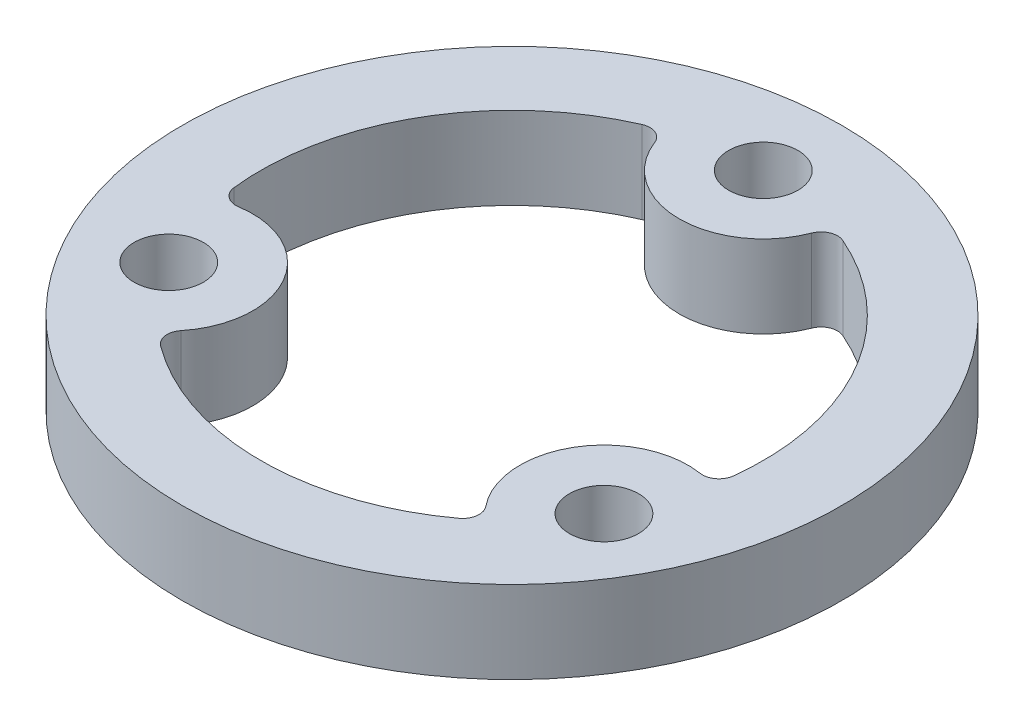
ISO-10303-21;
HEADER;
FILE_DESCRIPTION(('STEP AP214'),'2;1');
FILE_NAME('part.step','',(''),(''),'','','');
FILE_SCHEMA(('AUTOMOTIVE_DESIGN { 1 0 10303 214 1 1 1 1 }'));
ENDSEC;
DATA;
#1=APPLICATION_CONTEXT('core data for automotive mechanical design processes');
#2=APPLICATION_PROTOCOL_DEFINITION('international standard','automotive_design',2000,#1);
#3=PRODUCT_CONTEXT('',#1,'mechanical');
#4=PRODUCT('Part','Part','',(#3));
#5=PRODUCT_RELATED_PRODUCT_CATEGORY('part','',(#4));
#6=PRODUCT_DEFINITION_FORMATION('','',#4);
#7=PRODUCT_DEFINITION_CONTEXT('part definition',#1,'design');
#8=PRODUCT_DEFINITION('design','',#6,#7);
#9=PRODUCT_DEFINITION_SHAPE('','',#8);
#10=(LENGTH_UNIT() NAMED_UNIT(*) SI_UNIT(.MILLI.,.METRE.));
#11=(NAMED_UNIT(*) PLANE_ANGLE_UNIT() SI_UNIT($,.RADIAN.));
#12=(NAMED_UNIT(*) SI_UNIT($,.STERADIAN.) SOLID_ANGLE_UNIT());
#13=UNCERTAINTY_MEASURE_WITH_UNIT(LENGTH_MEASURE(1.E-05),#10,'distance_accuracy_value','');
#14=(GEOMETRIC_REPRESENTATION_CONTEXT(3) GLOBAL_UNCERTAINTY_ASSIGNED_CONTEXT((#13)) GLOBAL_UNIT_ASSIGNED_CONTEXT((#10,
#11,#12)) REPRESENTATION_CONTEXT('',''));
#15=CARTESIAN_POINT('',(0.,0.,0.));
#16=DIRECTION('',(0.,0.,1.));
#17=DIRECTION('',(1.,0.,0.));
#18=AXIS2_PLACEMENT_3D('',#15,#16,#17);
#19=CARTESIAN_POINT('',(0.,5.,0.));
#20=DIRECTION('',(0.,1.,0.));
#21=DIRECTION('',(0.,0.,1.));
#22=AXIS2_PLACEMENT_3D('',#19,#20,#21);
#23=PLANE('',#22);
#24=CARTESIAN_POINT('',(-13.2068874077127,5.,7.62500000000001));
#25=DIRECTION('',(0.,1.,0.));
#26=DIRECTION('',(0.,0.,1.));
#27=AXIS2_PLACEMENT_3D('',#24,#25,#26);
#28=CIRCLE('',#27,2.1);
#29=CARTESIAN_POINT('',(-13.2068874077127,5.,9.72500000000001));
#30=VERTEX_POINT('',#29);
#31=EDGE_CURVE('E165',#30,#30,#28,.T.);
#32=ORIENTED_EDGE('',*,*,#31,.F.);
#33=EDGE_LOOP('',(#32));
#34=FACE_BOUND('',#33,.T.);
#35=CARTESIAN_POINT('',(0.,5.,-15.25));
#36=DIRECTION('',(0.,1.,0.));
#37=DIRECTION('',(0.,0.,1.));
#38=AXIS2_PLACEMENT_3D('',#35,#36,#37);
#39=CIRCLE('',#38,2.1);
#40=CARTESIAN_POINT('',(0.,5.,-13.15));
#41=VERTEX_POINT('',#40);
#42=EDGE_CURVE('E179',#41,#41,#39,.T.);
#43=ORIENTED_EDGE('',*,*,#42,.F.);
#44=EDGE_LOOP('',(#43));
#45=FACE_BOUND('',#44,.T.);
#46=CARTESIAN_POINT('',(0.,5.,0.));
#47=DIRECTION('',(0.,1.,0.));
#48=DIRECTION('',(0.,0.,1.));
#49=AXIS2_PLACEMENT_3D('',#46,#47,#48);
#50=CIRCLE('',#49,20.);
#51=CARTESIAN_POINT('',(0.,5.,20.));
#52=VERTEX_POINT('',#51);
#53=EDGE_CURVE('E185',#52,#52,#50,.T.);
#54=ORIENTED_EDGE('',*,*,#53,.T.);
#55=EDGE_LOOP('',(#54));
#56=FACE_BOUND('',#55,.T.);
#57=CARTESIAN_POINT('',(13.2068874077127,5.,7.625));
#58=DIRECTION('',(0.,1.,0.));
#59=DIRECTION('',(0.,0.,1.));
#60=AXIS2_PLACEMENT_3D('',#57,#58,#59);
#61=CIRCLE('',#60,2.1);
#62=CARTESIAN_POINT('',(13.2068874077127,5.,9.725));
#63=VERTEX_POINT('',#62);
#64=EDGE_CURVE('E173',#63,#63,#61,.T.);
#65=ORIENTED_EDGE('',*,*,#64,.F.);
#66=EDGE_LOOP('',(#65));
#67=FACE_BOUND('',#66,.T.);
#68=CARTESIAN_POINT('',(0.,5.,0.));
#69=DIRECTION('',(0.,1.,0.));
#70=DIRECTION('',(0.,0.,1.));
#71=AXIS2_PLACEMENT_3D('',#68,#69,#70);
#72=CIRCLE('',#71,15.25);
#73=CARTESIAN_POINT('',(-6.09399831904025,5.,-13.9794736842105));
#74=VERTEX_POINT('',#73);
#75=CARTESIAN_POINT('',(-15.1535785015825,5.,1.71217948719674));
#76=VERTEX_POINT('',#75);
#77=EDGE_CURVE('E156',#74,#76,#72,.T.);
#78=ORIENTED_EDGE('',*,*,#77,.F.);
#79=CARTESIAN_POINT('',(-5.69439187189007,5.,-13.0627868852459));
#80=DIRECTION('',(0.,1.,0.));
#81=DIRECTION('',(0.,0.,1.));
#82=AXIS2_PLACEMENT_3D('',#79,#80,#81);
#83=CIRCLE('',#82,1.);
#84=CARTESIAN_POINT('',(-4.7608850076458,5.,-13.4213464122548));
#85=VERTEX_POINT('',#84);
#86=EDGE_CURVE('E41',#74,#85,#83,.F.);
#87=ORIENTED_EDGE('',*,*,#86,.T.);
#88=CARTESIAN_POINT('',(0.,5.,-15.25));
#89=DIRECTION('',(0.,-1.,0.));
#90=DIRECTION('',(0.,0.,1.));
#91=AXIS2_PLACEMENT_3D('',#88,#89,#90);
#92=CIRCLE('',#91,5.1);
#93=CARTESIAN_POINT('',(4.7608850076458,5.,-13.4213464122548));
#94=VERTEX_POINT('',#93);
#95=EDGE_CURVE('E162',#94,#85,#92,.T.);
#96=ORIENTED_EDGE('',*,*,#95,.F.);
#97=CARTESIAN_POINT('',(5.69439187189007,5.,-13.0627868852459));
#98=DIRECTION('',(0.,1.,0.));
#99=DIRECTION('',(0.,0.,1.));
#100=AXIS2_PLACEMENT_3D('',#97,#98,#99);
#101=CIRCLE('',#100,1.);
#102=CARTESIAN_POINT('',(6.09399831904025,5.,-13.9794736842105));
#103=VERTEX_POINT('',#102);
#104=EDGE_CURVE('E224',#94,#103,#101,.F.);
#105=ORIENTED_EDGE('',*,*,#104,.T.);
#106=CARTESIAN_POINT('',(0.,5.,0.));
#107=DIRECTION('',(0.,1.,0.));
#108=DIRECTION('',(0.,0.,1.));
#109=AXIS2_PLACEMENT_3D('',#106,#107,#108);
#110=CIRCLE('',#109,15.25);
#111=CARTESIAN_POINT('',(15.1535785015825,5.,1.71217948719674));
#112=VERTEX_POINT('',#111);
#113=EDGE_CURVE('E154',#112,#103,#110,.T.);
#114=ORIENTED_EDGE('',*,*,#113,.F.);
#115=CARTESIAN_POINT('',(14.1599012227902,5.,1.59990542246253));
#116=DIRECTION('',(0.,1.,0.));
#117=DIRECTION('',(0.,0.,1.));
#118=AXIS2_PLACEMENT_3D('',#115,#116,#117);
#119=CIRCLE('',#118,1.);
#120=CARTESIAN_POINT('',(14.0036694498267,5.,2.58762584500965));
#121=VERTEX_POINT('',#120);
#122=EDGE_CURVE('E220',#112,#121,#119,.F.);
#123=ORIENTED_EDGE('',*,*,#122,.T.);
#124=CARTESIAN_POINT('',(13.2068874077127,5.,7.625));
#125=DIRECTION('',(0.,-1.,0.));
#126=DIRECTION('',(0.,0.,1.));
#127=AXIS2_PLACEMENT_3D('',#124,#125,#126);
#128=CIRCLE('',#127,5.1);
#129=CARTESIAN_POINT('',(9.24278444218087,5.,10.8337205672451));
#130=VERTEX_POINT('',#129);
#131=EDGE_CURVE('E150',#130,#121,#128,.T.);
#132=ORIENTED_EDGE('',*,*,#131,.F.);
#133=CARTESIAN_POINT('',(8.46550935090012,5.,11.4628814627834));
#134=DIRECTION('',(0.,1.,0.));
#135=DIRECTION('',(0.,0.,1.));
#136=AXIS2_PLACEMENT_3D('',#133,#134,#135);
#137=CIRCLE('',#136,1.);
#138=CARTESIAN_POINT('',(9.05958018254223,5.,12.2672941970138));
#139=VERTEX_POINT('',#138);
#140=EDGE_CURVE('E149',#130,#139,#137,.F.);
#141=ORIENTED_EDGE('',*,*,#140,.T.);
#142=CARTESIAN_POINT('',(0.,5.,0.));
#143=DIRECTION('',(0.,1.,0.));
#144=DIRECTION('',(0.,0.,1.));
#145=AXIS2_PLACEMENT_3D('',#142,#143,#144);
#146=CIRCLE('',#145,15.25);
#147=CARTESIAN_POINT('',(-9.05958018254222,5.,12.2672941970138));
#148=VERTEX_POINT('',#147);
#149=EDGE_CURVE('E140',#148,#139,#146,.T.);
#150=ORIENTED_EDGE('',*,*,#149,.F.);
#151=CARTESIAN_POINT('',(-8.46550935090011,5.,11.4628814627834));
#152=DIRECTION('',(0.,1.,0.));
#153=DIRECTION('',(0.,0.,1.));
#154=AXIS2_PLACEMENT_3D('',#151,#152,#153);
#155=CIRCLE('',#154,1.);
#156=CARTESIAN_POINT('',(-9.24278444218085,5.,10.8337205672451));
#157=VERTEX_POINT('',#156);
#158=EDGE_CURVE('E123',#148,#157,#155,.F.);
#159=ORIENTED_EDGE('',*,*,#158,.T.);
#160=CARTESIAN_POINT('',(-13.2068874077127,5.,7.62500000000001));
#161=DIRECTION('',(0.,-1.,0.));
#162=DIRECTION('',(0.,0.,1.));
#163=AXIS2_PLACEMENT_3D('',#160,#161,#162);
#164=CIRCLE('',#163,5.10000000000001);
#165=CARTESIAN_POINT('',(-14.0036694498267,5.,2.58762584500966));
#166=VERTEX_POINT('',#165);
#167=EDGE_CURVE('E151',#166,#157,#164,.T.);
#168=ORIENTED_EDGE('',*,*,#167,.F.);
#169=CARTESIAN_POINT('',(-14.1599012227902,5.,1.59990542246253));
#170=DIRECTION('',(0.,1.,0.));
#171=DIRECTION('',(0.,0.,1.));
#172=AXIS2_PLACEMENT_3D('',#169,#170,#171);
#173=CIRCLE('',#172,1.);
#174=EDGE_CURVE('E213',#166,#76,#173,.F.);
#175=ORIENTED_EDGE('',*,*,#174,.T.);
#176=EDGE_LOOP('',(#78,#87,#96,#105,#114,#123,#132,#141,#150,#159,#168,#175));
#177=FACE_BOUND('',#176,.T.);
#178=ADVANCED_FACE('F33',(#34,#45,#56,#67,#177),#23,.T.);
#179=CARTESIAN_POINT('',(0.,0.,0.));
#180=DIRECTION('',(0.,1.,0.));
#181=DIRECTION('',(0.,0.,1.));
#182=AXIS2_PLACEMENT_3D('',#179,#180,#181);
#183=PLANE('',#182);
#184=CARTESIAN_POINT('',(-13.2068874077127,0.,7.62500000000001));
#185=DIRECTION('',(0.,1.,0.));
#186=DIRECTION('',(0.,0.,1.));
#187=AXIS2_PLACEMENT_3D('',#184,#185,#186);
#188=CIRCLE('',#187,2.1);
#189=CARTESIAN_POINT('',(-13.2068874077127,0.,9.72500000000001));
#190=VERTEX_POINT('',#189);
#191=EDGE_CURVE('E169',#190,#190,#188,.T.);
#192=ORIENTED_EDGE('',*,*,#191,.T.);
#193=EDGE_LOOP('',(#192));
#194=FACE_BOUND('',#193,.T.);
#195=CARTESIAN_POINT('',(13.2068874077127,0.,7.625));
#196=DIRECTION('',(0.,1.,0.));
#197=DIRECTION('',(0.,0.,1.));
#198=AXIS2_PLACEMENT_3D('',#195,#196,#197);
#199=CIRCLE('',#198,2.1);
#200=CARTESIAN_POINT('',(13.2068874077127,0.,9.725));
#201=VERTEX_POINT('',#200);
#202=EDGE_CURVE('E168',#201,#201,#199,.T.);
#203=ORIENTED_EDGE('',*,*,#202,.T.);
#204=EDGE_LOOP('',(#203));
#205=FACE_BOUND('',#204,.T.);
#206=CARTESIAN_POINT('',(0.,0.,-15.25));
#207=DIRECTION('',(0.,1.,0.));
#208=DIRECTION('',(0.,0.,1.));
#209=AXIS2_PLACEMENT_3D('',#206,#207,#208);
#210=CIRCLE('',#209,2.1);
#211=CARTESIAN_POINT('',(0.,0.,-13.15));
#212=VERTEX_POINT('',#211);
#213=EDGE_CURVE('E176',#212,#212,#210,.T.);
#214=ORIENTED_EDGE('',*,*,#213,.T.);
#215=EDGE_LOOP('',(#214));
#216=FACE_BOUND('',#215,.T.);
#217=CARTESIAN_POINT('',(0.,0.,0.));
#218=DIRECTION('',(0.,1.,0.));
#219=DIRECTION('',(0.,0.,1.));
#220=AXIS2_PLACEMENT_3D('',#217,#218,#219);
#221=CIRCLE('',#220,20.);
#222=CARTESIAN_POINT('',(0.,0.,20.));
#223=VERTEX_POINT('',#222);
#224=EDGE_CURVE('E182',#223,#223,#221,.T.);
#225=ORIENTED_EDGE('',*,*,#224,.F.);
#226=EDGE_LOOP('',(#225));
#227=FACE_BOUND('',#226,.T.);
#228=CARTESIAN_POINT('',(0.,0.,0.));
#229=DIRECTION('',(0.,1.,0.));
#230=DIRECTION('',(0.,0.,1.));
#231=AXIS2_PLACEMENT_3D('',#228,#229,#230);
#232=CIRCLE('',#231,15.25);
#233=CARTESIAN_POINT('',(15.1535785015825,0.,1.71217948719674));
#234=VERTEX_POINT('',#233);
#235=CARTESIAN_POINT('',(6.09399831904025,0.,-13.9794736842105));
#236=VERTEX_POINT('',#235);
#237=EDGE_CURVE('E249',#234,#236,#232,.T.);
#238=ORIENTED_EDGE('',*,*,#237,.T.);
#239=CARTESIAN_POINT('',(5.69439187189007,0.,-13.0627868852459));
#240=DIRECTION('',(0.,1.,0.));
#241=DIRECTION('',(0.,0.,1.));
#242=AXIS2_PLACEMENT_3D('',#239,#240,#241);
#243=CIRCLE('',#242,1.);
#244=CARTESIAN_POINT('',(4.7608850076458,0.,-13.4213464122548));
#245=VERTEX_POINT('',#244);
#246=EDGE_CURVE('E55',#236,#245,#243,.T.);
#247=ORIENTED_EDGE('',*,*,#246,.T.);
#248=CARTESIAN_POINT('',(0.,0.,-15.25));
#249=DIRECTION('',(0.,-1.,0.));
#250=DIRECTION('',(0.,0.,1.));
#251=AXIS2_PLACEMENT_3D('',#248,#249,#250);
#252=CIRCLE('',#251,5.1);
#253=CARTESIAN_POINT('',(-4.7608850076458,0.,-13.4213464122548));
#254=VERTEX_POINT('',#253);
#255=EDGE_CURVE('E172',#245,#254,#252,.T.);
#256=ORIENTED_EDGE('',*,*,#255,.T.);
#257=CARTESIAN_POINT('',(-5.69439187189007,0.,-13.0627868852459));
#258=DIRECTION('',(0.,1.,0.));
#259=DIRECTION('',(0.,0.,1.));
#260=AXIS2_PLACEMENT_3D('',#257,#258,#259);
#261=CIRCLE('',#260,1.);
#262=CARTESIAN_POINT('',(-6.09399831904025,0.,-13.9794736842105));
#263=VERTEX_POINT('',#262);
#264=EDGE_CURVE('E11',#254,#263,#261,.T.);
#265=ORIENTED_EDGE('',*,*,#264,.T.);
#266=CARTESIAN_POINT('',(0.,0.,0.));
#267=DIRECTION('',(0.,1.,0.));
#268=DIRECTION('',(0.,0.,1.));
#269=AXIS2_PLACEMENT_3D('',#266,#267,#268);
#270=CIRCLE('',#269,15.25);
#271=CARTESIAN_POINT('',(-15.1535785015825,0.,1.71217948719674));
#272=VERTEX_POINT('',#271);
#273=EDGE_CURVE('E164',#263,#272,#270,.T.);
#274=ORIENTED_EDGE('',*,*,#273,.T.);
#275=CARTESIAN_POINT('',(-14.1599012227902,0.,1.59990542246253));
#276=DIRECTION('',(0.,1.,0.));
#277=DIRECTION('',(0.,0.,1.));
#278=AXIS2_PLACEMENT_3D('',#275,#276,#277);
#279=CIRCLE('',#278,1.);
#280=CARTESIAN_POINT('',(-14.0036694498267,0.,2.58762584500966));
#281=VERTEX_POINT('',#280);
#282=EDGE_CURVE('E215',#272,#281,#279,.T.);
#283=ORIENTED_EDGE('',*,*,#282,.T.);
#284=CARTESIAN_POINT('',(-13.2068874077127,0.,7.62500000000001));
#285=DIRECTION('',(0.,-1.,0.));
#286=DIRECTION('',(0.,0.,1.));
#287=AXIS2_PLACEMENT_3D('',#284,#285,#286);
#288=CIRCLE('',#287,5.10000000000001);
#289=CARTESIAN_POINT('',(-9.24278444218085,0.,10.8337205672451));
#290=VERTEX_POINT('',#289);
#291=EDGE_CURVE('E240',#281,#290,#288,.T.);
#292=ORIENTED_EDGE('',*,*,#291,.T.);
#293=CARTESIAN_POINT('',(-8.46550935090011,0.,11.4628814627834));
#294=DIRECTION('',(0.,1.,0.));
#295=DIRECTION('',(0.,0.,1.));
#296=AXIS2_PLACEMENT_3D('',#293,#294,#295);
#297=CIRCLE('',#296,1.);
#298=CARTESIAN_POINT('',(-9.05958018254222,0.,12.2672941970138));
#299=VERTEX_POINT('',#298);
#300=EDGE_CURVE('E133',#290,#299,#297,.T.);
#301=ORIENTED_EDGE('',*,*,#300,.T.);
#302=CARTESIAN_POINT('',(0.,0.,0.));
#303=DIRECTION('',(0.,1.,0.));
#304=DIRECTION('',(0.,0.,1.));
#305=AXIS2_PLACEMENT_3D('',#302,#303,#304);
#306=CIRCLE('',#305,15.25);
#307=CARTESIAN_POINT('',(9.05958018254223,0.,12.2672941970138));
#308=VERTEX_POINT('',#307);
#309=EDGE_CURVE('E143',#299,#308,#306,.T.);
#310=ORIENTED_EDGE('',*,*,#309,.T.);
#311=CARTESIAN_POINT('',(8.46550935090012,0.,11.4628814627834));
#312=DIRECTION('',(0.,1.,0.));
#313=DIRECTION('',(0.,0.,1.));
#314=AXIS2_PLACEMENT_3D('',#311,#312,#313);
#315=CIRCLE('',#314,1.);
#316=CARTESIAN_POINT('',(9.24278444218087,0.,10.8337205672451));
#317=VERTEX_POINT('',#316);
#318=EDGE_CURVE('E218',#308,#317,#315,.T.);
#319=ORIENTED_EDGE('',*,*,#318,.T.);
#320=CARTESIAN_POINT('',(13.2068874077127,0.,7.625));
#321=DIRECTION('',(0.,-1.,0.));
#322=DIRECTION('',(0.,0.,1.));
#323=AXIS2_PLACEMENT_3D('',#320,#321,#322);
#324=CIRCLE('',#323,5.1);
#325=CARTESIAN_POINT('',(14.0036694498267,0.,2.58762584500965));
#326=VERTEX_POINT('',#325);
#327=EDGE_CURVE('E246',#317,#326,#324,.T.);
#328=ORIENTED_EDGE('',*,*,#327,.T.);
#329=CARTESIAN_POINT('',(14.1599012227902,0.,1.59990542246253));
#330=DIRECTION('',(0.,1.,0.));
#331=DIRECTION('',(0.,0.,1.));
#332=AXIS2_PLACEMENT_3D('',#329,#330,#331);
#333=CIRCLE('',#332,1.);
#334=EDGE_CURVE('E222',#326,#234,#333,.T.);
#335=ORIENTED_EDGE('',*,*,#334,.T.);
#336=EDGE_LOOP('',(#238,#247,#256,#265,#274,#283,#292,#301,#310,#319,#328,#335));
#337=FACE_BOUND('',#336,.T.);
#338=ADVANCED_FACE('F235',(#194,#205,#216,#227,#337),#183,.F.);
#339=CARTESIAN_POINT('',(0.,5.,0.));
#340=DIRECTION('',(0.,-1.,0.));
#341=DIRECTION('',(0.,0.,-1.));
#342=AXIS2_PLACEMENT_3D('',#339,#340,#341);
#343=CYLINDRICAL_SURFACE('',#342,20.);
#344=ORIENTED_EDGE('',*,*,#53,.F.);
#345=EDGE_LOOP('',(#344));
#346=FACE_BOUND('',#345,.T.);
#347=ORIENTED_EDGE('',*,*,#224,.T.);
#348=EDGE_LOOP('',(#347));
#349=FACE_BOUND('',#348,.T.);
#350=ADVANCED_FACE('F273',(#346,#349),#343,.T.);
#351=CARTESIAN_POINT('',(0.,5.,-15.25));
#352=DIRECTION('',(0.,-1.,0.));
#353=DIRECTION('',(0.,0.,-1.));
#354=AXIS2_PLACEMENT_3D('',#351,#352,#353);
#355=CYLINDRICAL_SURFACE('',#354,2.1);
#356=ORIENTED_EDGE('',*,*,#42,.T.);
#357=EDGE_LOOP('',(#356));
#358=FACE_BOUND('',#357,.T.);
#359=ORIENTED_EDGE('',*,*,#213,.F.);
#360=EDGE_LOOP('',(#359));
#361=FACE_BOUND('',#360,.T.);
#362=ADVANCED_FACE('F279',(#358,#361),#355,.F.);
#363=CARTESIAN_POINT('',(13.2068874077127,5.,7.625));
#364=DIRECTION('',(0.,-1.,0.));
#365=DIRECTION('',(0.,0.,-1.));
#366=AXIS2_PLACEMENT_3D('',#363,#364,#365);
#367=CYLINDRICAL_SURFACE('',#366,2.1);
#368=ORIENTED_EDGE('',*,*,#64,.T.);
#369=EDGE_LOOP('',(#368));
#370=FACE_BOUND('',#369,.T.);
#371=ORIENTED_EDGE('',*,*,#202,.F.);
#372=EDGE_LOOP('',(#371));
#373=FACE_BOUND('',#372,.T.);
#374=ADVANCED_FACE('F327',(#370,#373),#367,.F.);
#375=CARTESIAN_POINT('',(-13.2068874077127,5.,7.62500000000001));
#376=DIRECTION('',(0.,-1.,0.));
#377=DIRECTION('',(0.,0.,-1.));
#378=AXIS2_PLACEMENT_3D('',#375,#376,#377);
#379=CYLINDRICAL_SURFACE('',#378,2.1);
#380=ORIENTED_EDGE('',*,*,#31,.T.);
#381=EDGE_LOOP('',(#380));
#382=FACE_BOUND('',#381,.T.);
#383=ORIENTED_EDGE('',*,*,#191,.F.);
#384=EDGE_LOOP('',(#383));
#385=FACE_BOUND('',#384,.T.);
#386=ADVANCED_FACE('F323',(#382,#385),#379,.F.);
#387=CARTESIAN_POINT('',(0.,0.,0.));
#388=DIRECTION('',(0.,1.,0.));
#389=DIRECTION('',(0.,0.,1.));
#390=AXIS2_PLACEMENT_3D('',#387,#388,#389);
#391=CYLINDRICAL_SURFACE('',#390,15.25);
#392=ORIENTED_EDGE('',*,*,#77,.T.);
#393=DIRECTION('',(0.,1.,0.));
#394=VECTOR('',#393,1.);
#395=CARTESIAN_POINT('',(-15.1535785015825,0.,1.71217948719674));
#396=LINE('',#395,#394);
#397=EDGE_CURVE('E197',#76,#272,#396,.F.);
#398=ORIENTED_EDGE('',*,*,#397,.T.);
#399=ORIENTED_EDGE('',*,*,#273,.F.);
#400=DIRECTION('',(0.,1.,0.));
#401=VECTOR('',#400,1.);
#402=CARTESIAN_POINT('',(-6.09399831904025,0.,-13.9794736842105));
#403=LINE('',#402,#401);
#404=EDGE_CURVE('E194',#263,#74,#403,.T.);
#405=ORIENTED_EDGE('',*,*,#404,.T.);
#406=EDGE_LOOP('',(#392,#398,#399,#405));
#407=FACE_BOUND('',#406,.T.);
#408=ADVANCED_FACE('F238',(#407),#391,.F.);
#409=CARTESIAN_POINT('',(0.,0.,-15.25));
#410=DIRECTION('',(0.,1.,0.));
#411=DIRECTION('',(0.,0.,1.));
#412=AXIS2_PLACEMENT_3D('',#409,#410,#411);
#413=CYLINDRICAL_SURFACE('',#412,5.1);
#414=ORIENTED_EDGE('',*,*,#255,.F.);
#415=DIRECTION('',(0.,1.,0.));
#416=VECTOR('',#415,1.);
#417=CARTESIAN_POINT('',(4.7608850076458,0.,-13.4213464122548));
#418=LINE('',#417,#416);
#419=EDGE_CURVE('E134',#245,#94,#418,.T.);
#420=ORIENTED_EDGE('',*,*,#419,.T.);
#421=ORIENTED_EDGE('',*,*,#95,.T.);
#422=DIRECTION('',(0.,1.,0.));
#423=VECTOR('',#422,1.);
#424=CARTESIAN_POINT('',(-4.7608850076458,0.,-13.4213464122548));
#425=LINE('',#424,#423);
#426=EDGE_CURVE('E48',#85,#254,#425,.F.);
#427=ORIENTED_EDGE('',*,*,#426,.T.);
#428=EDGE_LOOP('',(#414,#420,#421,#427));
#429=FACE_BOUND('',#428,.T.);
#430=ADVANCED_FACE('F230',(#429),#413,.T.);
#431=CARTESIAN_POINT('',(0.,0.,0.));
#432=DIRECTION('',(0.,1.,0.));
#433=DIRECTION('',(0.,0.,1.));
#434=AXIS2_PLACEMENT_3D('',#431,#432,#433);
#435=CYLINDRICAL_SURFACE('',#434,15.25);
#436=ORIENTED_EDGE('',*,*,#237,.F.);
#437=DIRECTION('',(0.,1.,0.));
#438=VECTOR('',#437,1.);
#439=CARTESIAN_POINT('',(15.1535785015825,0.,1.71217948719674));
#440=LINE('',#439,#438);
#441=EDGE_CURVE('E206',#234,#112,#440,.T.);
#442=ORIENTED_EDGE('',*,*,#441,.T.);
#443=ORIENTED_EDGE('',*,*,#113,.T.);
#444=DIRECTION('',(0.,1.,0.));
#445=VECTOR('',#444,1.);
#446=CARTESIAN_POINT('',(6.09399831904025,0.,-13.9794736842105));
#447=LINE('',#446,#445);
#448=EDGE_CURVE('E204',#103,#236,#447,.F.);
#449=ORIENTED_EDGE('',*,*,#448,.T.);
#450=EDGE_LOOP('',(#436,#442,#443,#449));
#451=FACE_BOUND('',#450,.T.);
#452=ADVANCED_FACE('F304',(#451),#435,.F.);
#453=CARTESIAN_POINT('',(13.2068874077127,0.,7.625));
#454=DIRECTION('',(0.,1.,0.));
#455=DIRECTION('',(0.,0.,1.));
#456=AXIS2_PLACEMENT_3D('',#453,#454,#455);
#457=CYLINDRICAL_SURFACE('',#456,5.1);
#458=ORIENTED_EDGE('',*,*,#327,.F.);
#459=DIRECTION('',(0.,1.,0.));
#460=VECTOR('',#459,1.);
#461=CARTESIAN_POINT('',(9.24278444218087,0.,10.8337205672451));
#462=LINE('',#461,#460);
#463=EDGE_CURVE('E201',#317,#130,#462,.T.);
#464=ORIENTED_EDGE('',*,*,#463,.T.);
#465=ORIENTED_EDGE('',*,*,#131,.T.);
#466=DIRECTION('',(0.,1.,0.));
#467=VECTOR('',#466,1.);
#468=CARTESIAN_POINT('',(14.0036694498267,0.,2.58762584500965));
#469=LINE('',#468,#467);
#470=EDGE_CURVE('E199',#121,#326,#469,.F.);
#471=ORIENTED_EDGE('',*,*,#470,.T.);
#472=EDGE_LOOP('',(#458,#464,#465,#471));
#473=FACE_BOUND('',#472,.T.);
#474=ADVANCED_FACE('F264',(#473),#457,.T.);
#475=CARTESIAN_POINT('',(0.,0.,0.));
#476=DIRECTION('',(0.,1.,0.));
#477=DIRECTION('',(0.,0.,1.));
#478=AXIS2_PLACEMENT_3D('',#475,#476,#477);
#479=CYLINDRICAL_SURFACE('',#478,15.25);
#480=ORIENTED_EDGE('',*,*,#309,.F.);
#481=DIRECTION('',(0.,1.,0.));
#482=VECTOR('',#481,1.);
#483=CARTESIAN_POINT('',(-9.05958018254222,0.,12.2672941970138));
#484=LINE('',#483,#482);
#485=EDGE_CURVE('E127',#299,#148,#484,.T.);
#486=ORIENTED_EDGE('',*,*,#485,.T.);
#487=ORIENTED_EDGE('',*,*,#149,.T.);
#488=DIRECTION('',(0.,1.,0.));
#489=VECTOR('',#488,1.);
#490=CARTESIAN_POINT('',(9.05958018254223,0.,12.2672941970138));
#491=LINE('',#490,#489);
#492=EDGE_CURVE('E145',#139,#308,#491,.F.);
#493=ORIENTED_EDGE('',*,*,#492,.T.);
#494=EDGE_LOOP('',(#480,#486,#487,#493));
#495=FACE_BOUND('',#494,.T.);
#496=ADVANCED_FACE('F139',(#495),#479,.F.);
#497=CARTESIAN_POINT('',(-13.2068874077127,0.,7.62500000000001));
#498=DIRECTION('',(0.,1.,0.));
#499=DIRECTION('',(0.,0.,1.));
#500=AXIS2_PLACEMENT_3D('',#497,#498,#499);
#501=CYLINDRICAL_SURFACE('',#500,5.10000000000001);
#502=ORIENTED_EDGE('',*,*,#167,.T.);
#503=DIRECTION('',(0.,1.,0.));
#504=VECTOR('',#503,1.);
#505=CARTESIAN_POINT('',(-9.24278444218085,0.,10.8337205672451));
#506=LINE('',#505,#504);
#507=EDGE_CURVE('E128',#157,#290,#506,.F.);
#508=ORIENTED_EDGE('',*,*,#507,.T.);
#509=ORIENTED_EDGE('',*,*,#291,.F.);
#510=DIRECTION('',(0.,1.,0.));
#511=VECTOR('',#510,1.);
#512=CARTESIAN_POINT('',(-14.0036694498267,0.,2.58762584500966));
#513=LINE('',#512,#511);
#514=EDGE_CURVE('E144',#281,#166,#513,.T.);
#515=ORIENTED_EDGE('',*,*,#514,.T.);
#516=EDGE_LOOP('',(#502,#508,#509,#515));
#517=FACE_BOUND('',#516,.T.);
#518=ADVANCED_FACE('F256',(#517),#501,.T.);
#519=CARTESIAN_POINT('',(-8.46550935090011,0.,11.4628814627834));
#520=DIRECTION('',(0.,1.,0.));
#521=DIRECTION('',(0.,0.,1.));
#522=AXIS2_PLACEMENT_3D('',#519,#520,#521);
#523=CYLINDRICAL_SURFACE('',#522,1.);
#524=ORIENTED_EDGE('',*,*,#300,.F.);
#525=ORIENTED_EDGE('',*,*,#507,.F.);
#526=ORIENTED_EDGE('',*,*,#158,.F.);
#527=ORIENTED_EDGE('',*,*,#485,.F.);
#528=EDGE_LOOP('',(#524,#525,#526,#527));
#529=FACE_BOUND('',#528,.T.);
#530=ADVANCED_FACE('F126',(#529),#523,.F.);
#531=CARTESIAN_POINT('',(-14.1599012227902,0.,1.59990542246253));
#532=DIRECTION('',(0.,1.,0.));
#533=DIRECTION('',(0.,0.,1.));
#534=AXIS2_PLACEMENT_3D('',#531,#532,#533);
#535=CYLINDRICAL_SURFACE('',#534,1.);
#536=ORIENTED_EDGE('',*,*,#282,.F.);
#537=ORIENTED_EDGE('',*,*,#397,.F.);
#538=ORIENTED_EDGE('',*,*,#174,.F.);
#539=ORIENTED_EDGE('',*,*,#514,.F.);
#540=EDGE_LOOP('',(#536,#537,#538,#539));
#541=FACE_BOUND('',#540,.T.);
#542=ADVANCED_FACE('F252',(#541),#535,.F.);
#543=CARTESIAN_POINT('',(8.46550935090012,0.,11.4628814627834));
#544=DIRECTION('',(0.,1.,0.));
#545=DIRECTION('',(0.,0.,1.));
#546=AXIS2_PLACEMENT_3D('',#543,#544,#545);
#547=CYLINDRICAL_SURFACE('',#546,1.);
#548=ORIENTED_EDGE('',*,*,#318,.F.);
#549=ORIENTED_EDGE('',*,*,#492,.F.);
#550=ORIENTED_EDGE('',*,*,#140,.F.);
#551=ORIENTED_EDGE('',*,*,#463,.F.);
#552=EDGE_LOOP('',(#548,#549,#550,#551));
#553=FACE_BOUND('',#552,.T.);
#554=ADVANCED_FACE('F287',(#553),#547,.F.);
#555=CARTESIAN_POINT('',(14.1599012227902,0.,1.59990542246253));
#556=DIRECTION('',(0.,1.,0.));
#557=DIRECTION('',(0.,0.,1.));
#558=AXIS2_PLACEMENT_3D('',#555,#556,#557);
#559=CYLINDRICAL_SURFACE('',#558,1.);
#560=ORIENTED_EDGE('',*,*,#334,.F.);
#561=ORIENTED_EDGE('',*,*,#470,.F.);
#562=ORIENTED_EDGE('',*,*,#122,.F.);
#563=ORIENTED_EDGE('',*,*,#441,.F.);
#564=EDGE_LOOP('',(#560,#561,#562,#563));
#565=FACE_BOUND('',#564,.T.);
#566=ADVANCED_FACE('F290',(#565),#559,.F.);
#567=CARTESIAN_POINT('',(5.69439187189007,0.,-13.0627868852459));
#568=DIRECTION('',(0.,1.,0.));
#569=DIRECTION('',(0.,0.,1.));
#570=AXIS2_PLACEMENT_3D('',#567,#568,#569);
#571=CYLINDRICAL_SURFACE('',#570,1.);
#572=ORIENTED_EDGE('',*,*,#246,.F.);
#573=ORIENTED_EDGE('',*,*,#448,.F.);
#574=ORIENTED_EDGE('',*,*,#104,.F.);
#575=ORIENTED_EDGE('',*,*,#419,.F.);
#576=EDGE_LOOP('',(#572,#573,#574,#575));
#577=FACE_BOUND('',#576,.T.);
#578=ADVANCED_FACE('F293',(#577),#571,.F.);
#579=CARTESIAN_POINT('',(-5.69439187189007,0.,-13.0627868852459));
#580=DIRECTION('',(0.,1.,0.));
#581=DIRECTION('',(0.,0.,1.));
#582=AXIS2_PLACEMENT_3D('',#579,#580,#581);
#583=CYLINDRICAL_SURFACE('',#582,1.);
#584=ORIENTED_EDGE('',*,*,#264,.F.);
#585=ORIENTED_EDGE('',*,*,#426,.F.);
#586=ORIENTED_EDGE('',*,*,#86,.F.);
#587=ORIENTED_EDGE('',*,*,#404,.F.);
#588=EDGE_LOOP('',(#584,#585,#586,#587));
#589=FACE_BOUND('',#588,.T.);
#590=ADVANCED_FACE('F35',(#589),#583,.F.);
#591=CLOSED_SHELL('',(#178,#338,#350,#362,#374,#386,#408,#430,#452,#474,#496,#518,#530,#542,
#554,#566,#578,#590));
#592=MANIFOLD_SOLID_BREP('B2',#591);
#593=ADVANCED_BREP_SHAPE_REPRESENTATION('',(#18,#592),#14);
#594=SHAPE_DEFINITION_REPRESENTATION(#9,#593);
ENDSEC;
END-ISO-10303-21;
